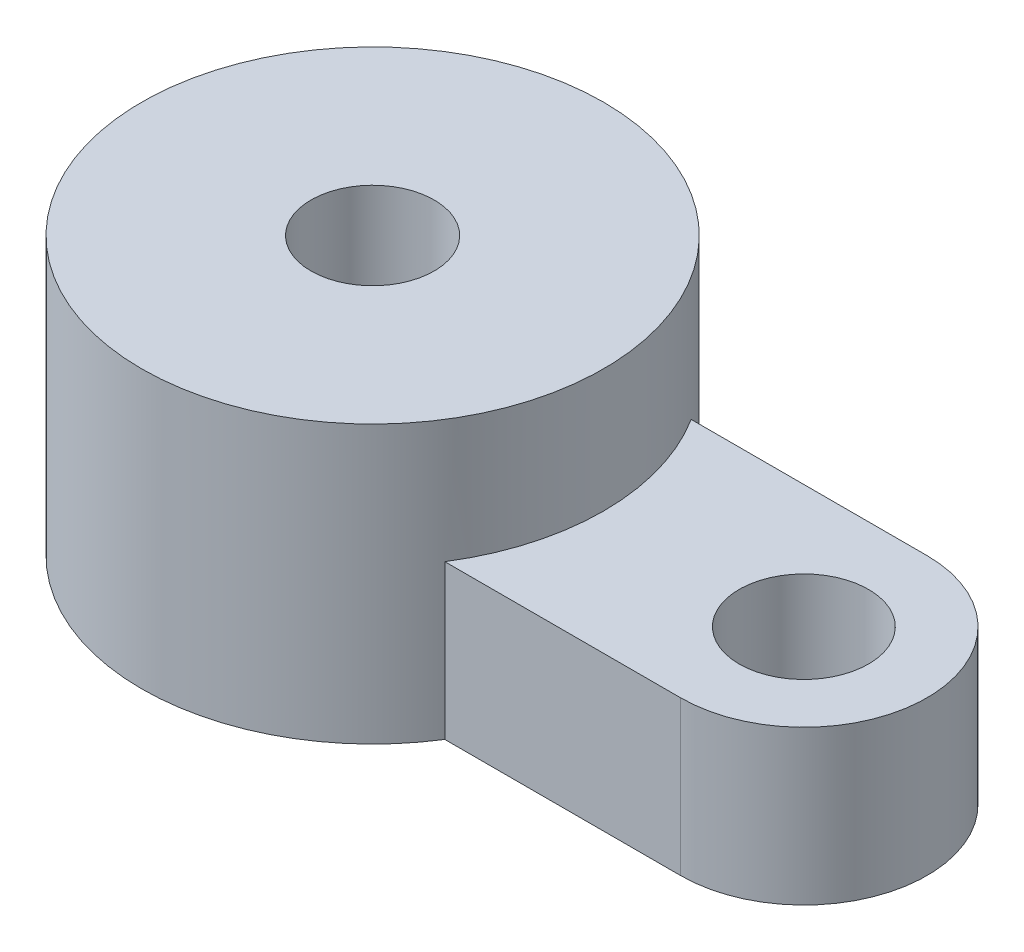
ISO-10303-21;
HEADER;
FILE_DESCRIPTION(('STEP AP214'),'2;1');
FILE_NAME('part.step','',(''),(''),'','','');
FILE_SCHEMA(('AUTOMOTIVE_DESIGN { 1 0 10303 214 1 1 1 1 }'));
ENDSEC;
DATA;
#1=APPLICATION_CONTEXT('core data for automotive mechanical design processes');
#2=APPLICATION_PROTOCOL_DEFINITION('international standard','automotive_design',2000,#1);
#3=PRODUCT_CONTEXT('',#1,'mechanical');
#4=PRODUCT('Part','Part','',(#3));
#5=PRODUCT_RELATED_PRODUCT_CATEGORY('part','',(#4));
#6=PRODUCT_DEFINITION_FORMATION('','',#4);
#7=PRODUCT_DEFINITION_CONTEXT('part definition',#1,'design');
#8=PRODUCT_DEFINITION('design','',#6,#7);
#9=PRODUCT_DEFINITION_SHAPE('','',#8);
#10=(LENGTH_UNIT() NAMED_UNIT(*) SI_UNIT(.MILLI.,.METRE.));
#11=(NAMED_UNIT(*) PLANE_ANGLE_UNIT() SI_UNIT($,.RADIAN.));
#12=(NAMED_UNIT(*) SI_UNIT($,.STERADIAN.) SOLID_ANGLE_UNIT());
#13=UNCERTAINTY_MEASURE_WITH_UNIT(LENGTH_MEASURE(1.E-05),#10,'distance_accuracy_value','');
#14=(GEOMETRIC_REPRESENTATION_CONTEXT(3) GLOBAL_UNCERTAINTY_ASSIGNED_CONTEXT((#13)) GLOBAL_UNIT_ASSIGNED_CONTEXT((#10,
#11,#12)) REPRESENTATION_CONTEXT('',''));
#15=CARTESIAN_POINT('',(0.,0.,0.));
#16=DIRECTION('',(0.,0.,1.));
#17=DIRECTION('',(1.,0.,0.));
#18=AXIS2_PLACEMENT_3D('',#15,#16,#17);
#19=CARTESIAN_POINT('',(0.,5.,0.));
#20=DIRECTION('',(0.,1.,0.));
#21=DIRECTION('',(0.,0.,1.));
#22=AXIS2_PLACEMENT_3D('',#19,#20,#21);
#23=PLANE('',#22);
#24=CARTESIAN_POINT('',(0.,5.,0.));
#25=DIRECTION('',(0.,1.,0.));
#26=DIRECTION('',(0.,0.,1.));
#27=AXIS2_PLACEMENT_3D('',#24,#25,#26);
#28=CIRCLE('',#27,7.5);
#29=CARTESIAN_POINT('',(6.34428877022476,5.,4.));
#30=VERTEX_POINT('',#29);
#31=CARTESIAN_POINT('',(6.34428877022476,5.,-4.));
#32=VERTEX_POINT('',#31);
#33=EDGE_CURVE('E55',#30,#32,#28,.T.);
#34=ORIENTED_EDGE('',*,*,#33,.F.);
#35=DIRECTION('',(1.,0.,0.));
#36=VECTOR('',#35,1.);
#37=CARTESIAN_POINT('',(0.,5.,4.));
#38=LINE('',#37,#36);
#39=CARTESIAN_POINT('',(14.003,5.,4.));
#40=VERTEX_POINT('',#39);
#41=EDGE_CURVE('E78',#30,#40,#38,.T.);
#42=ORIENTED_EDGE('',*,*,#41,.T.);
#43=CARTESIAN_POINT('',(14.003,5.,0.));
#44=DIRECTION('',(0.,1.,0.));
#45=DIRECTION('',(0.,0.,1.));
#46=AXIS2_PLACEMENT_3D('',#43,#44,#45);
#47=CIRCLE('',#46,4.);
#48=CARTESIAN_POINT('',(14.003,5.,-4.));
#49=VERTEX_POINT('',#48);
#50=EDGE_CURVE('E82',#40,#49,#47,.T.);
#51=ORIENTED_EDGE('',*,*,#50,.T.);
#52=DIRECTION('',(-1.,0.,0.));
#53=VECTOR('',#52,1.);
#54=CARTESIAN_POINT('',(0.,5.,-4.));
#55=LINE('',#54,#53);
#56=EDGE_CURVE('E95',#49,#32,#55,.T.);
#57=ORIENTED_EDGE('',*,*,#56,.T.);
#58=EDGE_LOOP('',(#34,#42,#51,#57));
#59=FACE_BOUND('',#58,.T.);
#60=CARTESIAN_POINT('',(14.003,5.,0.));
#61=DIRECTION('',(0.,1.,0.));
#62=DIRECTION('',(0.,0.,1.));
#63=AXIS2_PLACEMENT_3D('',#60,#61,#62);
#64=CIRCLE('',#63,2.1);
#65=CARTESIAN_POINT('',(14.003,5.,2.1));
#66=VERTEX_POINT('',#65);
#67=EDGE_CURVE('E102',#66,#66,#64,.T.);
#68=ORIENTED_EDGE('',*,*,#67,.F.);
#69=EDGE_LOOP('',(#68));
#70=FACE_BOUND('',#69,.T.);
#71=ADVANCED_FACE('F34',(#59,#70),#23,.T.);
#72=CARTESIAN_POINT('',(0.,0.,0.));
#73=DIRECTION('',(0.,1.,0.));
#74=DIRECTION('',(0.,0.,1.));
#75=AXIS2_PLACEMENT_3D('',#72,#73,#74);
#76=PLANE('',#75);
#77=DIRECTION('',(1.,0.,0.));
#78=VECTOR('',#77,1.);
#79=CARTESIAN_POINT('',(0.,0.,4.));
#80=LINE('',#79,#78);
#81=CARTESIAN_POINT('',(6.34428877022476,0.,4.));
#82=VERTEX_POINT('',#81);
#83=CARTESIAN_POINT('',(14.003,0.,4.));
#84=VERTEX_POINT('',#83);
#85=EDGE_CURVE('E87',#82,#84,#80,.T.);
#86=ORIENTED_EDGE('',*,*,#85,.F.);
#87=CARTESIAN_POINT('',(0.,0.,0.));
#88=DIRECTION('',(0.,1.,0.));
#89=DIRECTION('',(0.,0.,1.));
#90=AXIS2_PLACEMENT_3D('',#87,#88,#89);
#91=CIRCLE('',#90,7.5);
#92=CARTESIAN_POINT('',(6.34428877022476,0.,-4.));
#93=VERTEX_POINT('',#92);
#94=EDGE_CURVE('E114',#93,#82,#91,.T.);
#95=ORIENTED_EDGE('',*,*,#94,.F.);
#96=DIRECTION('',(-1.,0.,0.));
#97=VECTOR('',#96,1.);
#98=CARTESIAN_POINT('',(0.,0.,-4.));
#99=LINE('',#98,#97);
#100=CARTESIAN_POINT('',(14.003,0.,-4.));
#101=VERTEX_POINT('',#100);
#102=EDGE_CURVE('E84',#101,#93,#99,.T.);
#103=ORIENTED_EDGE('',*,*,#102,.F.);
#104=CARTESIAN_POINT('',(14.003,0.,0.));
#105=DIRECTION('',(0.,1.,0.));
#106=DIRECTION('',(0.,0.,1.));
#107=AXIS2_PLACEMENT_3D('',#104,#105,#106);
#108=CIRCLE('',#107,4.);
#109=EDGE_CURVE('E101',#84,#101,#108,.T.);
#110=ORIENTED_EDGE('',*,*,#109,.F.);
#111=EDGE_LOOP('',(#86,#95,#103,#110));
#112=FACE_BOUND('',#111,.T.);
#113=CARTESIAN_POINT('',(14.003,0.,0.));
#114=DIRECTION('',(0.,1.,0.));
#115=DIRECTION('',(0.,0.,1.));
#116=AXIS2_PLACEMENT_3D('',#113,#114,#115);
#117=CIRCLE('',#116,2.1);
#118=CARTESIAN_POINT('',(14.003,0.,2.1));
#119=VERTEX_POINT('',#118);
#120=EDGE_CURVE('E125',#119,#119,#117,.T.);
#121=ORIENTED_EDGE('',*,*,#120,.T.);
#122=EDGE_LOOP('',(#121));
#123=FACE_BOUND('',#122,.T.);
#124=CARTESIAN_POINT('',(0.,0.,0.));
#125=DIRECTION('',(0.,1.,0.));
#126=DIRECTION('',(0.,0.,1.));
#127=AXIS2_PLACEMENT_3D('',#124,#125,#126);
#128=CIRCLE('',#127,2.);
#129=CARTESIAN_POINT('',(0.,0.,2.));
#130=VERTEX_POINT('',#129);
#131=EDGE_CURVE('E116',#130,#130,#128,.T.);
#132=ORIENTED_EDGE('',*,*,#131,.T.);
#133=EDGE_LOOP('',(#132));
#134=FACE_BOUND('',#133,.T.);
#135=ADVANCED_FACE('F111',(#112,#123,#134),#76,.F.);
#136=CARTESIAN_POINT('',(0.,5.,4.));
#137=DIRECTION('',(0.,0.,-1.));
#138=DIRECTION('',(-1.,0.,0.));
#139=AXIS2_PLACEMENT_3D('',#136,#137,#138);
#140=PLANE('',#139);
#141=ORIENTED_EDGE('',*,*,#41,.F.);
#142=DIRECTION('',(0.,1.,0.));
#143=VECTOR('',#142,1.);
#144=CARTESIAN_POINT('',(6.34428877022476,0.,4.));
#145=LINE('',#144,#143);
#146=EDGE_CURVE('E62',#30,#82,#145,.F.);
#147=ORIENTED_EDGE('',*,*,#146,.T.);
#148=ORIENTED_EDGE('',*,*,#85,.T.);
#149=DIRECTION('',(0.,-1.,0.));
#150=VECTOR('',#149,1.);
#151=CARTESIAN_POINT('',(14.003,5.,4.));
#152=LINE('',#151,#150);
#153=EDGE_CURVE('E48',#40,#84,#152,.T.);
#154=ORIENTED_EDGE('',*,*,#153,.F.);
#155=EDGE_LOOP('',(#141,#147,#148,#154));
#156=FACE_BOUND('',#155,.T.);
#157=ADVANCED_FACE('F36',(#156),#140,.F.);
#158=CARTESIAN_POINT('',(14.003,5.,0.));
#159=DIRECTION('',(0.,-1.,0.));
#160=DIRECTION('',(0.,0.,-1.));
#161=AXIS2_PLACEMENT_3D('',#158,#159,#160);
#162=CYLINDRICAL_SURFACE('',#161,4.);
#163=ORIENTED_EDGE('',*,*,#109,.T.);
#164=DIRECTION('',(0.,-1.,0.));
#165=VECTOR('',#164,1.);
#166=CARTESIAN_POINT('',(14.003,5.,-4.));
#167=LINE('',#166,#165);
#168=EDGE_CURVE('E90',#49,#101,#167,.T.);
#169=ORIENTED_EDGE('',*,*,#168,.F.);
#170=ORIENTED_EDGE('',*,*,#50,.F.);
#171=ORIENTED_EDGE('',*,*,#153,.T.);
#172=EDGE_LOOP('',(#163,#169,#170,#171));
#173=FACE_BOUND('',#172,.T.);
#174=ADVANCED_FACE('F92',(#173),#162,.T.);
#175=CARTESIAN_POINT('',(0.,5.,-4.));
#176=DIRECTION('',(0.,0.,1.));
#177=DIRECTION('',(1.,0.,0.));
#178=AXIS2_PLACEMENT_3D('',#175,#176,#177);
#179=PLANE('',#178);
#180=ORIENTED_EDGE('',*,*,#102,.T.);
#181=DIRECTION('',(0.,1.,0.));
#182=VECTOR('',#181,1.);
#183=CARTESIAN_POINT('',(6.34428877022476,0.,-4.));
#184=LINE('',#183,#182);
#185=EDGE_CURVE('E11',#93,#32,#184,.T.);
#186=ORIENTED_EDGE('',*,*,#185,.T.);
#187=ORIENTED_EDGE('',*,*,#56,.F.);
#188=ORIENTED_EDGE('',*,*,#168,.T.);
#189=EDGE_LOOP('',(#180,#186,#187,#188));
#190=FACE_BOUND('',#189,.T.);
#191=ADVANCED_FACE('F107',(#190),#179,.F.);
#192=CARTESIAN_POINT('',(14.003,5.,0.));
#193=DIRECTION('',(0.,-1.,0.));
#194=DIRECTION('',(0.,0.,-1.));
#195=AXIS2_PLACEMENT_3D('',#192,#193,#194);
#196=CYLINDRICAL_SURFACE('',#195,2.1);
#197=ORIENTED_EDGE('',*,*,#67,.T.);
#198=EDGE_LOOP('',(#197));
#199=FACE_BOUND('',#198,.T.);
#200=ORIENTED_EDGE('',*,*,#120,.F.);
#201=EDGE_LOOP('',(#200));
#202=FACE_BOUND('',#201,.T.);
#203=ADVANCED_FACE('F131',(#199,#202),#196,.F.);
#204=CARTESIAN_POINT('',(0.,0.,0.));
#205=DIRECTION('',(0.,1.,0.));
#206=DIRECTION('',(0.,0.,1.));
#207=AXIS2_PLACEMENT_3D('',#204,#205,#206);
#208=CYLINDRICAL_SURFACE('',#207,7.5);
#209=CARTESIAN_POINT('',(1.85,4.5,-7.26825288497862));
#210=CARTESIAN_POINT('',(1.84999701945354,4.39779545481421,-7.26825486082757));
#211=CARTESIAN_POINT('',(1.84150161179009,4.29555762824011,-7.27043218607052));
#212=CARTESIAN_POINT('',(1.80779668641078,4.09401469890532,-7.27888470229559));
#213=CARTESIAN_POINT('',(1.78257717926134,3.9947113860048,-7.28516234239364));
#214=CARTESIAN_POINT('',(1.71628732551156,3.80198183927889,-7.30106222740579));
#215=CARTESIAN_POINT('',(1.67523709242178,3.70854832213523,-7.31068022673712));
#216=CARTESIAN_POINT('',(1.57851193399542,3.52988496798039,-7.33217186136139));
#217=CARTESIAN_POINT('',(1.5228364891435,3.44465542253687,-7.34404557677749));
#218=CARTESIAN_POINT('',(1.3971672883788,3.28299298872091,-7.36899554417413));
#219=CARTESIAN_POINT('',(1.3269177647517,3.20676178475876,-7.38209059222813));
#220=CARTESIAN_POINT('',(1.17464558462328,3.06703557983593,-7.40784452628445));
#221=CARTESIAN_POINT('',(1.09262185075481,3.00354174564978,-7.42050337224168));
#222=CARTESIAN_POINT('',(0.917751188604596,2.89027053772096,-7.44416619418083));
#223=CARTESIAN_POINT('',(0.824772580424896,2.84069083291032,-7.45514540264215));
#224=CARTESIAN_POINT('',(0.631485101306086,2.75793980084663,-7.47399769302506));
#225=CARTESIAN_POINT('',(0.531177284764248,2.72476611869777,-7.48187122069854));
#226=CARTESIAN_POINT('',(0.328180768741065,2.67641350955964,-7.49349214662237));
#227=CARTESIAN_POINT('',(0.225578185899175,2.66089221044994,-7.49731794544234));
#228=CARTESIAN_POINT('',(0.019158918865107,2.64721075002216,-7.50068538004914));
#229=CARTESIAN_POINT('',(-0.0846575882408209,2.64904808723449,-7.50022763311724));
#230=CARTESIAN_POINT('',(-0.288184809444513,2.66978451658579,-7.49513808853608));
#231=CARTESIAN_POINT('',(-0.387935769720569,2.68831411280956,-7.49059668958484));
#232=CARTESIAN_POINT('',(-0.582866448818278,2.74131573093401,-7.47795511258719));
#233=CARTESIAN_POINT('',(-0.67804592768054,2.77578858869731,-7.46985474795483));
#234=CARTESIAN_POINT('',(-0.862111163215455,2.86000021719889,-7.45086631213736));
#235=CARTESIAN_POINT('',(-0.950933740561143,2.9098714375383,-7.4399541958413));
#236=CARTESIAN_POINT('',(-1.11907937015067,3.02336386285497,-7.41652741075039));
#237=CARTESIAN_POINT('',(-1.19840080541465,3.08698740315861,-7.40401246992193));
#238=CARTESIAN_POINT('',(-1.34749559113529,3.22816277075988,-7.37835594237615));
#239=CARTESIAN_POINT('',(-1.41696210857668,3.30603756126964,-7.36520653334496));
#240=CARTESIAN_POINT('',(-1.5419170719206,3.47246879812906,-7.3400657864591));
#241=CARTESIAN_POINT('',(-1.59740489951589,3.56102571671589,-7.32807449984512));
#242=CARTESIAN_POINT('',(-1.69301687790303,3.74689723667896,-7.30658042210099));
#243=CARTESIAN_POINT('',(-1.73306897108085,3.84425035487828,-7.29708936626072));
#244=CARTESIAN_POINT('',(-1.79614381106017,4.04459837703862,-7.28182201853041));
#245=CARTESIAN_POINT('',(-1.81917009283373,4.14759210509965,-7.27604495555776));
#246=CARTESIAN_POINT('',(-1.8470343715668,4.35345689589765,-7.26902104192534));
#247=CARTESIAN_POINT('',(-1.85232526125063,4.45626288319021,-7.26766141559094));
#248=CARTESIAN_POINT('',(-1.84580691637142,4.66128879549479,-7.26931964806234));
#249=CARTESIAN_POINT('',(-1.83399920968732,4.76350877205156,-7.27233711574428));
#250=CARTESIAN_POINT('',(-1.79401550834617,4.96279125100179,-7.28230164983431));
#251=CARTESIAN_POINT('',(-1.76610157386241,5.05990978002077,-7.28918575664365));
#252=CARTESIAN_POINT('',(-1.69498757221564,5.24808942625301,-7.30604846325907));
#253=CARTESIAN_POINT('',(-1.65178573145682,5.33914983918929,-7.31602742209162));
#254=CARTESIAN_POINT('',(-1.55036876917363,5.51455193473986,-7.33819405637013));
#255=CARTESIAN_POINT('',(-1.49188194946612,5.59873153153947,-7.35042037428176));
#256=CARTESIAN_POINT('',(-1.36190012572386,5.75624784593262,-7.37560854959062));
#257=CARTESIAN_POINT('',(-1.29040304312105,5.82958282755163,-7.38857052429109));
#258=CARTESIAN_POINT('',(-1.1343549683243,5.96515412026785,-7.41415056319729));
#259=CARTESIAN_POINT('',(-1.04952911655042,6.0270776322846,-7.42675262988873));
#260=CARTESIAN_POINT('',(-0.870419478993563,6.13580039108439,-7.44986652212811));
#261=CARTESIAN_POINT('',(-0.776136183178085,6.18260042084903,-7.46037845587676));
#262=CARTESIAN_POINT('',(-0.581435054984203,6.2593468395723,-7.47806192361786));
#263=CARTESIAN_POINT('',(-0.481066777157382,6.28941322349843,-7.4852571754009));
#264=CARTESIAN_POINT('',(-0.276501801314435,6.3322010368343,-7.49560027183338));
#265=CARTESIAN_POINT('',(-0.172305825055886,6.34492571916039,-7.49874887553742));
#266=CARTESIAN_POINT('',(0.0340149001020092,6.35249001089473,-7.50061387572961));
#267=CARTESIAN_POINT('',(0.136121928660091,6.34779181306238,-7.49944481429089));
#268=CARTESIAN_POINT('',(0.338043764385129,6.32169955435788,-7.4930588757483));
#269=CARTESIAN_POINT('',(0.437858636366402,6.30030596617393,-7.48784211324499));
#270=CARTESIAN_POINT('',(0.631893068710851,6.24167533415221,-7.47396364149009));
#271=CARTESIAN_POINT('',(0.726138631998539,6.20451986959725,-7.46531968533393));
#272=CARTESIAN_POINT('',(0.907110891546686,6.11549458739848,-7.44549840082833));
#273=CARTESIAN_POINT('',(0.993836660579174,6.0636229585377,-7.43432076067549));
#274=CARTESIAN_POINT('',(1.15950639598227,5.94521722221328,-7.41031186562637));
#275=CARTESIAN_POINT('',(1.23822056569274,5.87836819355308,-7.39744801606065));
#276=CARTESIAN_POINT('',(1.38347087043577,5.73251939781351,-7.37166617606656));
#277=CARTESIAN_POINT('',(1.45000393363223,5.65351657500386,-7.3587481728195));
#278=CARTESIAN_POINT('',(1.57017915837707,5.48388781752536,-7.33405604047932));
#279=CARTESIAN_POINT('',(1.62356721934131,5.39307797234119,-7.32230673999189));
#280=CARTESIAN_POINT('',(1.71423926177484,5.20349583283981,-7.30161366015382));
#281=CARTESIAN_POINT('',(1.75153518192279,5.10472950617897,-7.29266780229645));
#282=CARTESIAN_POINT('',(1.80328503104528,4.9217526123998,-7.28002204944971));
#283=CARTESIAN_POINT('',(1.8207654991262,4.83843217061808,-7.27564136526891));
#284=CARTESIAN_POINT('',(1.84412375712645,4.67008207657465,-7.2697560765765));
#285=CARTESIAN_POINT('',(1.85000248035069,4.58505256235561,-7.26825124071695));
#286=CARTESIAN_POINT('',(1.85,4.5,-7.26825288497862));
#287=B_SPLINE_CURVE_WITH_KNOTS('',3,(#209,#210,#211,#212,#213,#214,#215,#216,#217,#218,#219,
#220,#221,#222,#223,#224,#225,#226,#227,#228,#229,#230,#231,#232,#233,#234,#235,#236,#237,#238,
#239,#240,#241,#242,#243,#244,#245,#246,#247,#248,#249,#250,#251,#252,#253,#254,#255,#256,#257,
#258,#259,#260,#261,#262,#263,#264,#265,#266,#267,#268,#269,#270,#271,#272,#273,#274,#275,#276,
#277,#278,#279,#280,#281,#282,#283,#284,#285,#286),.UNSPECIFIED.,.T.,.F.,(4,2,2,2,2,2,2,2,2,2,2,
2,2,2,2,2,2,2,2,2,2,2,2,2,2,2,2,2,2,2,2,2,2,2,2,2,2,2,4),(0.,0.306301370906472,
0.612785862975463,0.918882231533547,1.22498947468721,1.53700868442672,1.84905646285817,
2.16533558669976,2.48156929912582,2.79155899702434,3.10150402447984,3.40475234470337,
3.70801656522884,4.0139656315909,4.31996669303687,4.63403458950012,4.94811637541741,
5.2636471038003,5.57911230192918,5.88645775461069,6.19377574552514,6.4962290524425,
6.7987174593838,7.10699935586116,7.41533054791372,7.73114993602214,8.04695297072725,
8.36046123980885,8.67391069363523,8.97910519496657,9.28429105579272,9.58791626558796,
9.89157886079626,10.2023526717182,10.5132047460732,10.8296624794867,11.1458850291066,
11.4008033636225,11.6557011903412),.UNSPECIFIED.);
#288=CARTESIAN_POINT('',(1.85,4.5,-7.26825288497862));
#289=VERTEX_POINT('',#288);
#290=EDGE_CURVE('E223',#289,#289,#287,.T.);
#291=ORIENTED_EDGE('',*,*,#290,.F.);
#292=EDGE_LOOP('',(#291));
#293=FACE_BOUND('',#292,.T.);
#294=CARTESIAN_POINT('',(0.,9.,0.));
#295=DIRECTION('',(0.,1.,0.));
#296=DIRECTION('',(0.,0.,1.));
#297=AXIS2_PLACEMENT_3D('',#294,#295,#296);
#298=CIRCLE('',#297,7.5);
#299=CARTESIAN_POINT('',(0.,9.,7.5));
#300=VERTEX_POINT('',#299);
#301=EDGE_CURVE('E120',#300,#300,#298,.T.);
#302=ORIENTED_EDGE('',*,*,#301,.F.);
#303=EDGE_LOOP('',(#302));
#304=FACE_BOUND('',#303,.T.);
#305=ORIENTED_EDGE('',*,*,#146,.F.);
#306=ORIENTED_EDGE('',*,*,#33,.T.);
#307=ORIENTED_EDGE('',*,*,#185,.F.);
#308=ORIENTED_EDGE('',*,*,#94,.T.);
#309=EDGE_LOOP('',(#305,#306,#307,#308));
#310=FACE_BOUND('',#309,.T.);
#311=ADVANCED_FACE('F133',(#293,#304,#310),#208,.T.);
#312=CARTESIAN_POINT('',(0.,0.,0.));
#313=DIRECTION('',(0.,1.,0.));
#314=DIRECTION('',(0.,0.,1.));
#315=AXIS2_PLACEMENT_3D('',#312,#313,#314);
#316=CYLINDRICAL_SURFACE('',#315,2.);
#317=CARTESIAN_POINT('',(1.85,4.5,-0.759934207678533));
#318=CARTESIAN_POINT('',(1.85000078026974,4.44911509016056,-0.759930759406363));
#319=CARTESIAN_POINT('',(1.84786950292113,4.39823270469295,-0.765178974200174));
#320=CARTESIAN_POINT('',(1.83967455948843,4.29842090989514,-0.784665756368735));
#321=CARTESIAN_POINT('',(1.83358967907111,4.24950355699031,-0.798952813632648));
#322=CARTESIAN_POINT('',(1.81402122446671,4.12953568535811,-0.842697758222696));
#323=CARTESIAN_POINT('',(1.79832896614513,4.06039248211364,-0.876182684993655));
#324=CARTESIAN_POINT('',(1.76058205867274,3.92760335771273,-0.949783497265297));
#325=CARTESIAN_POINT('',(1.73850369458973,3.86397909753358,-0.98992385627409));
#326=CARTESIAN_POINT('',(1.6900543921119,3.7449748475729,-1.07041537754437));
#327=CARTESIAN_POINT('',(1.66404385832811,3.68932792509285,-1.11059219434071));
#328=CARTESIAN_POINT('',(1.60692123210283,3.58128276662735,-1.19175169480676));
#329=CARTESIAN_POINT('',(1.57580541334303,3.52888694238731,-1.23273494771586));
#330=CARTESIAN_POINT('',(1.50846741843425,3.42727815326675,-1.31427527999897));
#331=CARTESIAN_POINT('',(1.47225270042112,3.37806069011207,-1.3548328904768));
#332=CARTESIAN_POINT('',(1.39456606871746,3.28284757456636,-1.43467426088039));
#333=CARTESIAN_POINT('',(1.35309394985569,3.23685204802094,-1.47395797101674));
#334=CARTESIAN_POINT('',(1.2433011002457,3.12692813515136,-1.56899046324157));
#335=CARTESIAN_POINT('',(1.17171035104494,3.06511418613219,-1.62349031486594));
#336=CARTESIAN_POINT('',(1.01646193020857,2.95128024617068,-1.72492754369935));
#337=CARTESIAN_POINT('',(0.93282597400892,2.8992430104639,-1.77187821510805));
#338=CARTESIAN_POINT('',(0.772307630113977,2.81701820957855,-1.84653635951518));
#339=CARTESIAN_POINT('',(0.697528395481582,2.78453888673208,-1.87621554675872));
#340=CARTESIAN_POINT('',(0.541713640529689,2.72916233180451,-1.92697774226713));
#341=CARTESIAN_POINT('',(0.46068181241863,2.70625949525077,-1.94806577816829));
#342=CARTESIAN_POINT('',(0.293701251067271,2.67146133125326,-1.98015346274179));
#343=CARTESIAN_POINT('',(0.2077228089839,2.65964197562124,-1.99108347869413));
#344=CARTESIAN_POINT('',(0.0342762779447221,2.64828049897119,-2.00158936718911));
#345=CARTESIAN_POINT('',(-0.0531910828357542,2.6487325396119,-2.00117063910447));
#346=CARTESIAN_POINT('',(-0.216790376539249,2.66111870334171,-1.98971867813331));
#347=CARTESIAN_POINT('',(-0.29310885425917,2.67178141057383,-1.9798608041139));
#348=CARTESIAN_POINT('',(-0.44237033672603,2.70205389921399,-1.95194162743146));
#349=CARTESIAN_POINT('',(-0.515312802997884,2.72166510253075,-1.93387902104521));
#350=CARTESIAN_POINT('',(-0.659157901107941,2.76968448648595,-1.88981389578466));
#351=CARTESIAN_POINT('',(-0.729864204029065,2.7984113525139,-1.86352431220424));
#352=CARTESIAN_POINT('',(-0.865107387760474,2.86301625333643,-1.80472671949755));
#353=CARTESIAN_POINT('',(-0.929641420758143,2.89889756578111,-1.77221586050867));
#354=CARTESIAN_POINT('',(-1.08431453890351,2.99700328324641,-1.68398766499126));
#355=CARTESIAN_POINT('',(-1.17012439083002,3.06317213757226,-1.62504376655646));
#356=CARTESIAN_POINT('',(-1.32655820098884,3.2061546273945,-1.50010844047034));
#357=CARTESIAN_POINT('',(-1.39713561574099,3.28299974104882,-1.43409630971598));
#358=CARTESIAN_POINT('',(-1.52515705773277,3.44759208681253,-1.29724183657908));
#359=CARTESIAN_POINT('',(-1.58222615595608,3.53556489356372,-1.22631977011424));
#360=CARTESIAN_POINT('',(-1.65645680575978,3.6745376586451,-1.1216028171626));
#361=CARTESIAN_POINT('',(-1.67929140923484,3.72199092851956,-1.08700131184056));
#362=CARTESIAN_POINT('',(-1.72116258257634,3.81961521442603,-1.01939671944295));
#363=CARTESIAN_POINT('',(-1.74020231367742,3.86978392374152,-0.98639231943771));
#364=CARTESIAN_POINT('',(-1.77195515167046,3.96625432603214,-0.927967580210054));
#365=CARTESIAN_POINT('',(-1.78517906636062,4.01213119448976,-0.902129646401964));
#366=CARTESIAN_POINT('',(-1.8083946977132,4.10683100483664,-0.854636589418745));
#367=CARTESIAN_POINT('',(-1.81838894489363,4.15565160448008,-0.832978196864488));
#368=CARTESIAN_POINT('',(-1.83317360291098,4.24754416652215,-0.799841923473564));
#369=CARTESIAN_POINT('',(-1.8385730919767,4.29009640637727,-0.787238957593345));
#370=CARTESIAN_POINT('',(-1.8464063424543,4.3768470911855,-0.768693732408951));
#371=CARTESIAN_POINT('',(-1.84884903530634,4.42104016080758,-0.76273141841477));
#372=CARTESIAN_POINT('',(-1.85051123018629,4.51015825955837,-0.758693460363637));
#373=CARTESIAN_POINT('',(-1.84970995088272,4.55508616576888,-0.760668664542077));
#374=CARTESIAN_POINT('',(-1.84493935583682,4.64382726078948,-0.772160900770258));
#375=CARTESIAN_POINT('',(-1.84096250944447,4.68763754407176,-0.781695859903285));
#376=CARTESIAN_POINT('',(-1.82787099443359,4.79197263571985,-0.811944065702536));
#377=CARTESIAN_POINT('',(-1.81726625787772,4.8513788988607,-0.835728673467739));
#378=CARTESIAN_POINT('',(-1.7913206548599,4.96599535826667,-0.889988719894845));
#379=CARTESIAN_POINT('',(-1.77595970286915,5.02118649786628,-0.920492372401373));
#380=CARTESIAN_POINT('',(-1.74051689359628,5.12963696328581,-0.98591624552202));
#381=CARTESIAN_POINT('',(-1.72030862796596,5.18279057618706,-1.02094055826349));
#382=CARTESIAN_POINT('',(-1.67563032033611,5.28608608986167,-1.0927289212812));
#383=CARTESIAN_POINT('',(-1.65115648541351,5.33622525638337,-1.12949449851153));
#384=CARTESIAN_POINT('',(-1.59795601214358,5.43387868858873,-1.20358672302397));
#385=CARTESIAN_POINT('',(-1.56922380072333,5.48138940071382,-1.24091404708151));
#386=CARTESIAN_POINT('',(-1.50748061315878,5.57382103911561,-1.31523343573429));
#387=CARTESIAN_POINT('',(-1.47446955679805,5.61874191681731,-1.35222549403031));
#388=CARTESIAN_POINT('',(-1.40166395491461,5.7088899189051,-1.42767871708761));
#389=CARTESIAN_POINT('',(-1.36156074584676,5.75393007951716,-1.46606868413735));
#390=CARTESIAN_POINT('',(-1.2762645301112,5.84065617268682,-1.54090285262911));
#391=CARTESIAN_POINT('',(-1.23106991917353,5.88234104087864,-1.57734643541522));
#392=CARTESIAN_POINT('',(-1.08795292822619,6.00138665896101,-1.68233542160104));
#393=CARTESIAN_POINT('',(-0.982095113894446,6.07324967940302,-1.74697617038343));
#394=CARTESIAN_POINT('',(-0.796235008006953,6.17177430866695,-1.83632688249702));
#395=CARTESIAN_POINT('',(-0.722434946571852,6.20509817926107,-1.86674332236354));
#396=CARTESIAN_POINT('',(-0.568452082317732,6.26240967364072,-1.91923220773181));
#397=CARTESIAN_POINT('',(-0.488274077402117,6.28640423700936,-1.94131085492838));
#398=CARTESIAN_POINT('',(-0.32274856121781,6.32361550617983,-1.97560662579538));
#399=CARTESIAN_POINT('',(-0.237368639251038,6.33675517107335,-1.98775325243284));
#400=CARTESIAN_POINT('',(-0.0647594554048771,6.35088887740202,-2.00082025563511));
#401=CARTESIAN_POINT('',(0.0224688996499598,6.35188874237851,-2.00174601492293));
#402=CARTESIAN_POINT('',(0.186451939493163,6.34221889778875,-1.99280414736069));
#403=CARTESIAN_POINT('',(0.263346046333007,6.33276145106967,-1.98405775221678));
#404=CARTESIAN_POINT('',(0.413968353941519,6.30471641197161,-1.95818085094147));
#405=CARTESIAN_POINT('',(0.487696093889044,6.28612749549645,-1.94104912890862));
#406=CARTESIAN_POINT('',(0.632448937745345,6.24024173385928,-1.89890918501231));
#407=CARTESIAN_POINT('',(0.703337813965376,6.21271256884829,-1.87369108132294));
#408=CARTESIAN_POINT('',(0.839127415631548,6.15044086584879,-1.81694585916216));
#409=CARTESIAN_POINT('',(0.904025140667732,6.11569474156189,-1.78541560429828));
#410=CARTESIAN_POINT('',(1.05899990232153,6.02084872819259,-1.69995766109552));
#411=CARTESIAN_POINT('',(1.14495342529916,5.95687688638163,-1.64282861816525));
#412=CARTESIAN_POINT('',(1.3020787382201,5.81837694484743,-1.52135118473562));
#413=CARTESIAN_POINT('',(1.37321048600274,5.74382114131331,-1.45698394300421));
#414=CARTESIAN_POINT('',(1.5027016290822,5.58408276880682,-1.32314775239064));
#415=CARTESIAN_POINT('',(1.56070554603524,5.498684656743,-1.2535924650325));
#416=CARTESIAN_POINT('',(1.63670763817628,5.36390526045975,-1.15022907778569));
#417=CARTESIAN_POINT('',(1.66019943366528,5.31788776874727,-1.11595173474674));
#418=CARTESIAN_POINT('',(1.70352766084833,5.22332604830981,-1.04861289633759));
#419=CARTESIAN_POINT('',(1.72336631054658,5.17478337586221,-1.01555067303463));
#420=CARTESIAN_POINT('',(1.75909352330449,5.07520612146417,-0.952309506741585));
#421=CARTESIAN_POINT('',(1.77502066969518,5.02420235816509,-0.922104372216619));
#422=CARTESIAN_POINT('',(1.8028625739623,4.91853381654977,-0.866401008468554));
#423=CARTESIAN_POINT('',(1.81477808966803,4.86386973203945,-0.840901890652723));
#424=CARTESIAN_POINT('',(1.83254692809901,4.75829364397624,-0.801361401324863));
#425=CARTESIAN_POINT('',(1.83901396723886,4.70792166346882,-0.786218021276169));
#426=CARTESIAN_POINT('',(1.84772797281624,4.60502276527139,-0.765533792514527));
#427=CARTESIAN_POINT('',(1.84999919481052,4.55251003854063,-0.759937766079346));
#428=CARTESIAN_POINT('',(1.85,4.5,-0.759934207678533));
#429=B_SPLINE_CURVE_WITH_KNOTS('',3,(#317,#318,#319,#320,#321,#322,#323,#324,#325,#326,#327,
#328,#329,#330,#331,#332,#333,#334,#335,#336,#337,#338,#339,#340,#341,#342,#343,#344,#345,#346,
#347,#348,#349,#350,#351,#352,#353,#354,#355,#356,#357,#358,#359,#360,#361,#362,#363,#364,#365,
#366,#367,#368,#369,#370,#371,#372,#373,#374,#375,#376,#377,#378,#379,#380,#381,#382,#383,#384,
#385,#386,#387,#388,#389,#390,#391,#392,#393,#394,#395,#396,#397,#398,#399,#400,#401,#402,#403,
#404,#405,#406,#407,#408,#409,#410,#411,#412,#413,#414,#415,#416,#417,#418,#419,#420,#421,#422,
#423,#424,#425,#426,#427,#428),.UNSPECIFIED.,.T.,.F.,(4,2,2,2,2,2,2,2,2,2,2,2,2,2,2,2,2,2,2,2,2,
2,2,2,2,2,2,2,2,2,2,2,2,2,2,2,2,2,2,2,2,2,2,2,2,2,2,2,2,2,2,2,2,2,2,4),(0.,0.152402225623713,
0.305629044305109,0.539532010158403,0.774314982830137,0.994228936883067,1.21430412482504,
1.43406069091763,1.65382583570055,1.98011590539421,2.30582492757112,2.56508589295145,
2.82419491726025,3.08506729584458,3.34581556179906,3.57781584322696,3.8098530021547,
4.05111339668198,4.29248457428767,4.66048792652971,5.02960029283725,5.40799544836567,
5.59689730452724,5.78564113636635,5.94828053677672,6.11079219478877,6.24443067032493,
6.37766445558856,6.5117531009773,6.64616067656412,6.83965378427167,7.03397542379847,
7.23405552086322,7.43431444437213,7.63483780603693,7.83536492750053,8.04953046426864,
8.26376367305305,8.68991167668786,8.94848088883195,9.20685739522125,9.46705230463575,
9.72712239191777,9.95993093883316,10.1927732537999,10.4322285263571,10.6718030764969,
11.0340558835336,11.3972750066047,11.7693898451964,11.9552765058234,12.1410499307053,
12.324909778048,12.5087348732724,12.6669217782851,12.8241913257095),.UNSPECIFIED.);
#430=CARTESIAN_POINT('',(1.85,4.5,-0.759934207678533));
#431=VERTEX_POINT('',#430);
#432=EDGE_CURVE('E38',#431,#431,#429,.T.);
#433=ORIENTED_EDGE('',*,*,#432,.T.);
#434=EDGE_LOOP('',(#433));
#435=FACE_BOUND('',#434,.T.);
#436=ORIENTED_EDGE('',*,*,#131,.F.);
#437=EDGE_LOOP('',(#436));
#438=FACE_BOUND('',#437,.T.);
#439=CARTESIAN_POINT('',(0.,9.,0.));
#440=DIRECTION('',(0.,1.,0.));
#441=DIRECTION('',(0.,0.,1.));
#442=AXIS2_PLACEMENT_3D('',#439,#440,#441);
#443=CIRCLE('',#442,2.);
#444=CARTESIAN_POINT('',(0.,9.,2.));
#445=VERTEX_POINT('',#444);
#446=EDGE_CURVE('E228',#445,#445,#443,.T.);
#447=ORIENTED_EDGE('',*,*,#446,.T.);
#448=EDGE_LOOP('',(#447));
#449=FACE_BOUND('',#448,.T.);
#450=ADVANCED_FACE('F140',(#435,#438,#449),#316,.F.);
#451=CARTESIAN_POINT('',(0.,9.,0.));
#452=DIRECTION('',(0.,1.,0.));
#453=DIRECTION('',(0.,0.,1.));
#454=AXIS2_PLACEMENT_3D('',#451,#452,#453);
#455=PLANE('',#454);
#456=ORIENTED_EDGE('',*,*,#301,.T.);
#457=EDGE_LOOP('',(#456));
#458=FACE_BOUND('',#457,.T.);
#459=ORIENTED_EDGE('',*,*,#446,.F.);
#460=EDGE_LOOP('',(#459));
#461=FACE_BOUND('',#460,.T.);
#462=ADVANCED_FACE('F187',(#458,#461),#455,.T.);
#463=CARTESIAN_POINT('',(0.,4.5,-12.));
#464=DIRECTION('',(0.,0.,1.));
#465=DIRECTION('',(1.,0.,0.));
#466=AXIS2_PLACEMENT_3D('',#463,#464,#465);
#467=CYLINDRICAL_SURFACE('',#466,1.85);
#468=ORIENTED_EDGE('',*,*,#290,.T.);
#469=EDGE_LOOP('',(#468));
#470=FACE_BOUND('',#469,.T.);
#471=ORIENTED_EDGE('',*,*,#432,.F.);
#472=EDGE_LOOP('',(#471));
#473=FACE_BOUND('',#472,.T.);
#474=ADVANCED_FACE('F192',(#470,#473),#467,.F.);
#475=CLOSED_SHELL('',(#71,#135,#157,#174,#191,#203,#311,#450,#462,#474));
#476=MANIFOLD_SOLID_BREP('B2',#475);
#477=ADVANCED_BREP_SHAPE_REPRESENTATION('',(#18,#476),#14);
#478=SHAPE_DEFINITION_REPRESENTATION(#9,#477);
ENDSEC;
END-ISO-10303-21;
